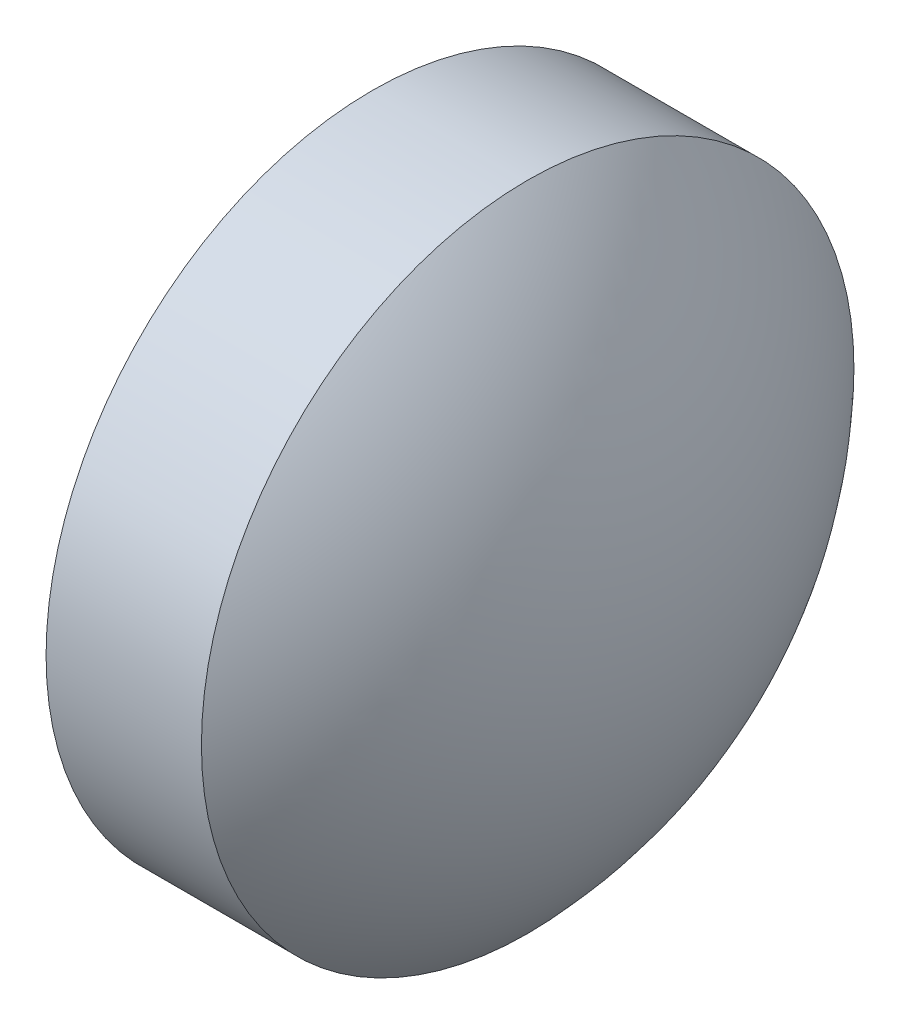
ISO-10303-21;
HEADER;
FILE_DESCRIPTION(('STEP AP214'),'2;1');
FILE_NAME('part.step','',(''),(''),'','','');
FILE_SCHEMA(('AUTOMOTIVE_DESIGN { 1 0 10303 214 1 1 1 1 }'));
ENDSEC;
DATA;
#1=APPLICATION_CONTEXT('core data for automotive mechanical design processes');
#2=APPLICATION_PROTOCOL_DEFINITION('international standard','automotive_design',2000,#1);
#3=PRODUCT_CONTEXT('',#1,'mechanical');
#4=PRODUCT('Part','Part','',(#3));
#5=PRODUCT_RELATED_PRODUCT_CATEGORY('part','',(#4));
#6=PRODUCT_DEFINITION_FORMATION('','',#4);
#7=PRODUCT_DEFINITION_CONTEXT('part definition',#1,'design');
#8=PRODUCT_DEFINITION('design','',#6,#7);
#9=PRODUCT_DEFINITION_SHAPE('','',#8);
#10=(LENGTH_UNIT() NAMED_UNIT(*) SI_UNIT(.MILLI.,.METRE.));
#11=(NAMED_UNIT(*) PLANE_ANGLE_UNIT() SI_UNIT($,.RADIAN.));
#12=(NAMED_UNIT(*) SI_UNIT($,.STERADIAN.) SOLID_ANGLE_UNIT());
#13=UNCERTAINTY_MEASURE_WITH_UNIT(LENGTH_MEASURE(1.E-05),#10,'distance_accuracy_value','');
#14=(GEOMETRIC_REPRESENTATION_CONTEXT(3) GLOBAL_UNCERTAINTY_ASSIGNED_CONTEXT((#13)) GLOBAL_UNIT_ASSIGNED_CONTEXT((#10,
#11,#12)) REPRESENTATION_CONTEXT('',''));
#15=CARTESIAN_POINT('',(0.,0.,0.));
#16=DIRECTION('',(0.,0.,1.));
#17=DIRECTION('',(1.,0.,0.));
#18=AXIS2_PLACEMENT_3D('',#15,#16,#17);
#19=CARTESIAN_POINT('',(389.114546637351,105.876474886447,0.));
#20=DIRECTION('',(-1.,0.,0.));
#21=DIRECTION('',(0.,1.,0.));
#22=AXIS2_PLACEMENT_3D('',#19,#20,#21);
#23=SPHERICAL_SURFACE('',#22,4.594);
#24=CARTESIAN_POINT('',(392.458546637351,105.876474886447,0.));
#25=DIRECTION('',(-1.,0.,0.));
#26=DIRECTION('',(0.,0.,1.));
#27=AXIS2_PLACEMENT_3D('',#24,#25,#26);
#28=CIRCLE('',#27,3.15);
#29=CARTESIAN_POINT('',(392.458546637351,105.876474886447,3.15));
#30=VERTEX_POINT('',#29);
#31=EDGE_CURVE('E10',#30,#30,#28,.T.);
#32=ORIENTED_EDGE('',*,*,#31,.F.);
#33=EDGE_LOOP('',(#32));
#34=FACE_BOUND('',#33,.T.);
#35=ADVANCED_FACE('F35',(#34),#23,.T.);
#36=CARTESIAN_POINT('',(390.097908548602,105.876474886447,0.));
#37=DIRECTION('',(-1.,0.,0.));
#38=DIRECTION('',(0.,0.,1.));
#39=AXIS2_PLACEMENT_3D('',#36,#37,#38);
#40=CYLINDRICAL_SURFACE('',#39,3.15);
#41=CARTESIAN_POINT('',(390.958546637351,105.876474886447,0.));
#42=DIRECTION('',(-1.,0.,0.));
#43=DIRECTION('',(0.,0.,1.));
#44=AXIS2_PLACEMENT_3D('',#41,#42,#43);
#45=CIRCLE('',#44,3.15);
#46=CARTESIAN_POINT('',(390.958546637351,105.876474886447,3.15));
#47=VERTEX_POINT('',#46);
#48=EDGE_CURVE('E41',#47,#47,#45,.T.);
#49=ORIENTED_EDGE('',*,*,#48,.F.);
#50=EDGE_LOOP('',(#49));
#51=FACE_BOUND('',#50,.T.);
#52=ORIENTED_EDGE('',*,*,#31,.T.);
#53=EDGE_LOOP('',(#52));
#54=FACE_BOUND('',#53,.T.);
#55=ADVANCED_FACE('F49',(#51,#54),#40,.T.);
#56=CARTESIAN_POINT('',(390.958546637351,105.876474886447,0.));
#57=DIRECTION('',(1.,0.,0.));
#58=DIRECTION('',(0.,0.,-1.));
#59=AXIS2_PLACEMENT_3D('',#56,#57,#58);
#60=PLANE('',#59);
#61=ORIENTED_EDGE('',*,*,#48,.T.);
#62=EDGE_LOOP('',(#61));
#63=FACE_BOUND('',#62,.T.);
#64=ADVANCED_FACE('F47',(#63),#60,.F.);
#65=CLOSED_SHELL('',(#35,#55,#64));
#66=MANIFOLD_SOLID_BREP('B2',#65);
#67=ADVANCED_BREP_SHAPE_REPRESENTATION('',(#18,#66),#14);
#68=SHAPE_DEFINITION_REPRESENTATION(#9,#67);
ENDSEC;
END-ISO-10303-21;
